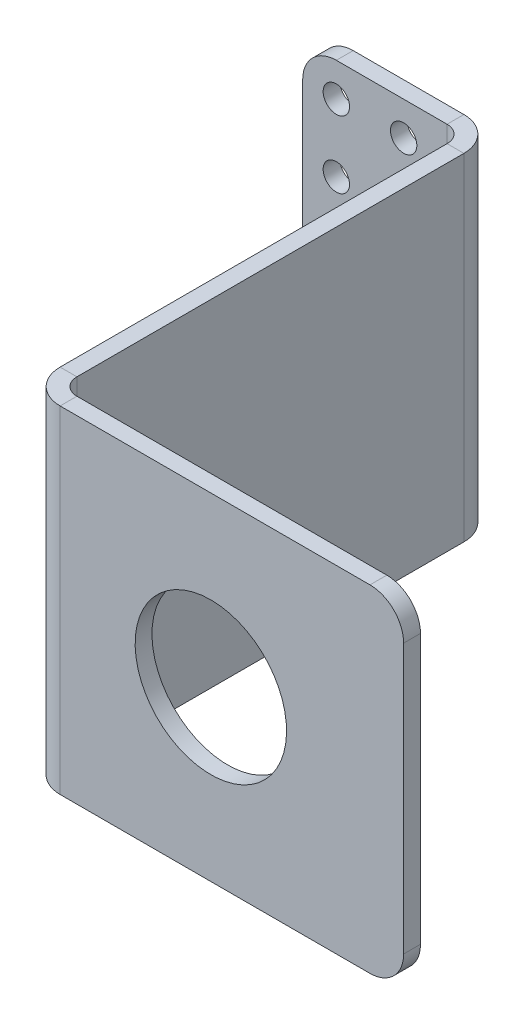
ISO-10303-21;
HEADER;
FILE_DESCRIPTION(('STEP AP214'),'2;1');
FILE_NAME('part.step','',(''),(''),'','','');
FILE_SCHEMA(('AUTOMOTIVE_DESIGN { 1 0 10303 214 1 1 1 1 }'));
ENDSEC;
DATA;
#1=APPLICATION_CONTEXT('core data for automotive mechanical design processes');
#2=APPLICATION_PROTOCOL_DEFINITION('international standard','automotive_design',2000,#1);
#3=PRODUCT_CONTEXT('',#1,'mechanical');
#4=PRODUCT('Part','Part','',(#3));
#5=PRODUCT_RELATED_PRODUCT_CATEGORY('part','',(#4));
#6=PRODUCT_DEFINITION_FORMATION('','',#4);
#7=PRODUCT_DEFINITION_CONTEXT('part definition',#1,'design');
#8=PRODUCT_DEFINITION('design','',#6,#7);
#9=PRODUCT_DEFINITION_SHAPE('','',#8);
#10=(LENGTH_UNIT() NAMED_UNIT(*) SI_UNIT(.MILLI.,.METRE.));
#11=(NAMED_UNIT(*) PLANE_ANGLE_UNIT() SI_UNIT($,.RADIAN.));
#12=(NAMED_UNIT(*) SI_UNIT($,.STERADIAN.) SOLID_ANGLE_UNIT());
#13=UNCERTAINTY_MEASURE_WITH_UNIT(LENGTH_MEASURE(1.E-05),#10,'distance_accuracy_value','');
#14=(GEOMETRIC_REPRESENTATION_CONTEXT(3) GLOBAL_UNCERTAINTY_ASSIGNED_CONTEXT((#13)) GLOBAL_UNIT_ASSIGNED_CONTEXT((#10,
#11,#12)) REPRESENTATION_CONTEXT('',''));
#15=CARTESIAN_POINT('',(0.,0.,0.));
#16=DIRECTION('',(0.,0.,1.));
#17=DIRECTION('',(1.,0.,0.));
#18=AXIS2_PLACEMENT_3D('',#15,#16,#17);
#19=CARTESIAN_POINT('',(33.5975412468198,0.,-28.3784587531803));
#20=DIRECTION('',(1.,0.,0.));
#21=DIRECTION('',(0.,0.,-1.));
#22=AXIS2_PLACEMENT_3D('',#19,#20,#21);
#23=PLANE('',#22);
#24=DIRECTION('',(0.,0.,-1.));
#25=VECTOR('',#24,1.);
#26=CARTESIAN_POINT('',(33.5975412468198,63.5,-28.3784587531803));
#27=LINE('',#26,#25);
#28=CARTESIAN_POINT('',(33.5975412468194,63.5,79.375));
#29=VERTEX_POINT('',#28);
#30=CARTESIAN_POINT('',(33.5975412468197,63.5,6.35000000000002));
#31=VERTEX_POINT('',#30);
#32=EDGE_CURVE('E320',#29,#31,#27,.T.);
#33=ORIENTED_EDGE('',*,*,#32,.F.);
#34=DIRECTION('',(0.,-1.,0.));
#35=VECTOR('',#34,1.);
#36=CARTESIAN_POINT('',(33.5975412468194,0.,79.375));
#37=LINE('',#36,#35);
#38=CARTESIAN_POINT('',(33.5975412468194,0.,79.375));
#39=VERTEX_POINT('',#38);
#40=EDGE_CURVE('E311',#29,#39,#37,.T.);
#41=ORIENTED_EDGE('',*,*,#40,.T.);
#42=DIRECTION('',(0.,0.,-1.));
#43=VECTOR('',#42,1.);
#44=CARTESIAN_POINT('',(33.5975412468198,0.,-28.3784587531803));
#45=LINE('',#44,#43);
#46=CARTESIAN_POINT('',(33.5975412468197,0.,6.35000000000002));
#47=VERTEX_POINT('',#46);
#48=EDGE_CURVE('E258',#47,#39,#45,.F.);
#49=ORIENTED_EDGE('',*,*,#48,.F.);
#50=DIRECTION('',(0.,-1.,0.));
#51=VECTOR('',#50,1.);
#52=CARTESIAN_POINT('',(33.5975412468197,0.,6.35000000000002));
#53=LINE('',#52,#51);
#54=EDGE_CURVE('E298',#31,#47,#53,.T.);
#55=ORIENTED_EDGE('',*,*,#54,.F.);
#56=EDGE_LOOP('',(#33,#41,#49,#55));
#57=FACE_BOUND('',#56,.T.);
#58=ADVANCED_FACE('F58',(#57),#23,.T.);
#59=CARTESIAN_POINT('',(30.4225412468198,0.,-28.3784587531804));
#60=DIRECTION('',(0.,1.,0.));
#61=DIRECTION('',(0.,0.,1.));
#62=AXIS2_PLACEMENT_3D('',#59,#60,#61);
#63=PLANE('',#62);
#64=ORIENTED_EDGE('',*,*,#48,.T.);
#65=DIRECTION('',(-1.,0.,0.));
#66=VECTOR('',#65,1.);
#67=CARTESIAN_POINT('',(30.4225412468194,0.,79.375));
#68=LINE('',#67,#66);
#69=CARTESIAN_POINT('',(30.4225412468194,0.,79.375));
#70=VERTEX_POINT('',#69);
#71=EDGE_CURVE('E209',#39,#70,#68,.T.);
#72=ORIENTED_EDGE('',*,*,#71,.T.);
#73=DIRECTION('',(0.,0.,1.));
#74=VECTOR('',#73,1.);
#75=CARTESIAN_POINT('',(30.4225412468198,0.,-28.3784587531804));
#76=LINE('',#75,#74);
#77=CARTESIAN_POINT('',(30.4225412468197,0.,6.35));
#78=VERTEX_POINT('',#77);
#79=EDGE_CURVE('E323',#78,#70,#76,.T.);
#80=ORIENTED_EDGE('',*,*,#79,.F.);
#81=DIRECTION('',(-1.,0.,0.));
#82=VECTOR('',#81,1.);
#83=CARTESIAN_POINT('',(30.4225412468197,0.,6.35000000000001));
#84=LINE('',#83,#82);
#85=EDGE_CURVE('E302',#47,#78,#84,.T.);
#86=ORIENTED_EDGE('',*,*,#85,.F.);
#87=EDGE_LOOP('',(#64,#72,#80,#86));
#88=FACE_BOUND('',#87,.T.);
#89=ADVANCED_FACE('F411',(#88),#63,.F.);
#90=CARTESIAN_POINT('',(30.4225412468198,63.5,-28.3784587531804));
#91=DIRECTION('',(0.,-1.,0.));
#92=DIRECTION('',(0.,0.,-1.));
#93=AXIS2_PLACEMENT_3D('',#90,#91,#92);
#94=PLANE('',#93);
#95=DIRECTION('',(0.,0.,-1.));
#96=VECTOR('',#95,1.);
#97=CARTESIAN_POINT('',(30.4225412468198,63.5,-28.3784587531804));
#98=LINE('',#97,#96);
#99=CARTESIAN_POINT('',(30.4225412468194,63.5,79.375));
#100=VERTEX_POINT('',#99);
#101=CARTESIAN_POINT('',(30.4225412468197,63.5,6.35000000000001));
#102=VERTEX_POINT('',#101);
#103=EDGE_CURVE('E295',#100,#102,#98,.T.);
#104=ORIENTED_EDGE('',*,*,#103,.F.);
#105=DIRECTION('',(1.,0.,0.));
#106=VECTOR('',#105,1.);
#107=CARTESIAN_POINT('',(30.4225412468194,63.5,79.375));
#108=LINE('',#107,#106);
#109=EDGE_CURVE('E315',#100,#29,#108,.T.);
#110=ORIENTED_EDGE('',*,*,#109,.T.);
#111=ORIENTED_EDGE('',*,*,#32,.T.);
#112=DIRECTION('',(1.,0.,0.));
#113=VECTOR('',#112,1.);
#114=CARTESIAN_POINT('',(30.4225412468197,63.5,6.35000000000001));
#115=LINE('',#114,#113);
#116=EDGE_CURVE('E294',#102,#31,#115,.T.);
#117=ORIENTED_EDGE('',*,*,#116,.F.);
#118=EDGE_LOOP('',(#104,#110,#111,#117));
#119=FACE_BOUND('',#118,.T.);
#120=ADVANCED_FACE('F416',(#119),#94,.F.);
#121=CARTESIAN_POINT('',(30.4225412468198,0.,-28.3784587531804));
#122=DIRECTION('',(1.,0.,0.));
#123=DIRECTION('',(0.,0.,-1.));
#124=AXIS2_PLACEMENT_3D('',#121,#122,#123);
#125=PLANE('',#124);
#126=DIRECTION('',(0.,-1.,0.));
#127=VECTOR('',#126,1.);
#128=CARTESIAN_POINT('',(30.4225412468194,0.,79.375));
#129=LINE('',#128,#127);
#130=EDGE_CURVE('E306',#100,#70,#129,.T.);
#131=ORIENTED_EDGE('',*,*,#130,.F.);
#132=ORIENTED_EDGE('',*,*,#103,.T.);
#133=DIRECTION('',(0.,-1.,0.));
#134=VECTOR('',#133,1.);
#135=CARTESIAN_POINT('',(30.4225412468197,0.,6.35000000000001));
#136=LINE('',#135,#134);
#137=EDGE_CURVE('E290',#102,#78,#136,.T.);
#138=ORIENTED_EDGE('',*,*,#137,.T.);
#139=ORIENTED_EDGE('',*,*,#79,.T.);
#140=EDGE_LOOP('',(#131,#132,#138,#139));
#141=FACE_BOUND('',#140,.T.);
#142=ADVANCED_FACE('F424',(#141),#125,.F.);
#143=CARTESIAN_POINT('',(0.,0.,3.175));
#144=DIRECTION('',(1.,0.,0.));
#145=DIRECTION('',(0.,-1.,0.));
#146=AXIS2_PLACEMENT_3D('',#143,#144,#145);
#147=PLANE('',#146);
#148=DIRECTION('',(0.,1.,0.));
#149=VECTOR('',#148,1.);
#150=CARTESIAN_POINT('',(0.,0.,0.));
#151=LINE('',#150,#149);
#152=CARTESIAN_POINT('',(0.,57.15,0.));
#153=VERTEX_POINT('',#152);
#154=CARTESIAN_POINT('',(0.,6.35,0.));
#155=VERTEX_POINT('',#154);
#156=EDGE_CURVE('E283',#153,#155,#151,.F.);
#157=ORIENTED_EDGE('',*,*,#156,.T.);
#158=DIRECTION('',(0.,0.,-1.));
#159=VECTOR('',#158,1.);
#160=CARTESIAN_POINT('',(0.,6.35,3.175));
#161=LINE('',#160,#159);
#162=CARTESIAN_POINT('',(0.,6.35,3.175));
#163=VERTEX_POINT('',#162);
#164=EDGE_CURVE('E357',#155,#163,#161,.F.);
#165=ORIENTED_EDGE('',*,*,#164,.T.);
#166=DIRECTION('',(0.,-1.,0.));
#167=VECTOR('',#166,1.);
#168=CARTESIAN_POINT('',(0.,0.,3.175));
#169=LINE('',#168,#167);
#170=CARTESIAN_POINT('',(0.,57.15,3.175));
#171=VERTEX_POINT('',#170);
#172=EDGE_CURVE('E275',#171,#163,#169,.T.);
#173=ORIENTED_EDGE('',*,*,#172,.F.);
#174=DIRECTION('',(0.,0.,-1.));
#175=VECTOR('',#174,1.);
#176=CARTESIAN_POINT('',(0.,57.15,3.175));
#177=LINE('',#176,#175);
#178=EDGE_CURVE('E354',#171,#153,#177,.T.);
#179=ORIENTED_EDGE('',*,*,#178,.T.);
#180=EDGE_LOOP('',(#157,#165,#173,#179));
#181=FACE_BOUND('',#180,.T.);
#182=ADVANCED_FACE('F377',(#181),#147,.F.);
#183=CARTESIAN_POINT('',(0.,0.,3.175));
#184=DIRECTION('',(0.,0.,-1.));
#185=DIRECTION('',(-1.,0.,0.));
#186=AXIS2_PLACEMENT_3D('',#183,#184,#185);
#187=PLANE('',#186);
#188=CARTESIAN_POINT('',(19.0500000000008,31.75,3.175));
#189=DIRECTION('',(0.,0.,1.));
#190=DIRECTION('',(-1.,0.,0.));
#191=AXIS2_PLACEMENT_3D('',#188,#189,#190);
#192=CIRCLE('',#191,2.4892);
#193=CARTESIAN_POINT('',(16.5608000000008,31.75,3.175));
#194=VERTEX_POINT('',#193);
#195=EDGE_CURVE('E594',#194,#194,#192,.T.);
#196=ORIENTED_EDGE('',*,*,#195,.F.);
#197=EDGE_LOOP('',(#196));
#198=FACE_BOUND('',#197,.T.);
#199=CARTESIAN_POINT('',(6.35000000000039,19.05,3.175));
#200=DIRECTION('',(0.,0.,1.));
#201=DIRECTION('',(1.,0.,0.));
#202=AXIS2_PLACEMENT_3D('',#199,#200,#201);
#203=CIRCLE('',#202,2.4892);
#204=CARTESIAN_POINT('',(8.8392000000004,19.05,3.175));
#205=VERTEX_POINT('',#204);
#206=EDGE_CURVE('E603',#205,#205,#203,.T.);
#207=ORIENTED_EDGE('',*,*,#206,.F.);
#208=EDGE_LOOP('',(#207));
#209=FACE_BOUND('',#208,.T.);
#210=CARTESIAN_POINT('',(19.0500000000009,19.05,3.175));
#211=DIRECTION('',(0.,0.,1.));
#212=DIRECTION('',(-1.,0.,0.));
#213=AXIS2_PLACEMENT_3D('',#210,#211,#212);
#214=CIRCLE('',#213,2.4892);
#215=CARTESIAN_POINT('',(16.5608000000009,19.05,3.175));
#216=VERTEX_POINT('',#215);
#217=EDGE_CURVE('E582',#216,#216,#214,.T.);
#218=ORIENTED_EDGE('',*,*,#217,.F.);
#219=EDGE_LOOP('',(#218));
#220=FACE_BOUND('',#219,.T.);
#221=CARTESIAN_POINT('',(6.35000000000053,6.35000000000002,3.175));
#222=DIRECTION('',(0.,0.,1.));
#223=DIRECTION('',(1.,0.,0.));
#224=AXIS2_PLACEMENT_3D('',#221,#222,#223);
#225=CIRCLE('',#224,2.4892);
#226=CARTESIAN_POINT('',(8.83920000000053,6.35000000000002,3.175));
#227=VERTEX_POINT('',#226);
#228=EDGE_CURVE('E577',#227,#227,#225,.T.);
#229=ORIENTED_EDGE('',*,*,#228,.F.);
#230=EDGE_LOOP('',(#229));
#231=FACE_BOUND('',#230,.T.);
#232=CARTESIAN_POINT('',(19.0500000000005,57.15,3.175));
#233=DIRECTION('',(0.,0.,1.));
#234=DIRECTION('',(-1.,0.,0.));
#235=AXIS2_PLACEMENT_3D('',#232,#233,#234);
#236=CIRCLE('',#235,2.4892);
#237=CARTESIAN_POINT('',(16.5608000000005,57.15,3.175));
#238=VERTEX_POINT('',#237);
#239=EDGE_CURVE('E625',#238,#238,#236,.T.);
#240=ORIENTED_EDGE('',*,*,#239,.F.);
#241=EDGE_LOOP('',(#240));
#242=FACE_BOUND('',#241,.T.);
#243=CARTESIAN_POINT('',(6.35000000000013,44.45,3.175));
#244=DIRECTION('',(0.,0.,1.));
#245=DIRECTION('',(1.,0.,0.));
#246=AXIS2_PLACEMENT_3D('',#243,#244,#245);
#247=CIRCLE('',#246,2.4892);
#248=CARTESIAN_POINT('',(8.83920000000013,44.45,3.175));
#249=VERTEX_POINT('',#248);
#250=EDGE_CURVE('E633',#249,#249,#247,.T.);
#251=ORIENTED_EDGE('',*,*,#250,.F.);
#252=EDGE_LOOP('',(#251));
#253=FACE_BOUND('',#252,.T.);
#254=CARTESIAN_POINT('',(19.0500000000007,44.45,3.175));
#255=DIRECTION('',(0.,0.,1.));
#256=DIRECTION('',(-1.,0.,0.));
#257=AXIS2_PLACEMENT_3D('',#254,#255,#256);
#258=CIRCLE('',#257,2.4892);
#259=CARTESIAN_POINT('',(16.5608000000007,44.45,3.175));
#260=VERTEX_POINT('',#259);
#261=EDGE_CURVE('E610',#260,#260,#258,.T.);
#262=ORIENTED_EDGE('',*,*,#261,.F.);
#263=EDGE_LOOP('',(#262));
#264=FACE_BOUND('',#263,.T.);
#265=CARTESIAN_POINT('',(6.35000000000026,31.75,3.175));
#266=DIRECTION('',(0.,0.,1.));
#267=DIRECTION('',(1.,0.,0.));
#268=AXIS2_PLACEMENT_3D('',#265,#266,#267);
#269=CIRCLE('',#268,2.4892);
#270=CARTESIAN_POINT('',(8.83920000000026,31.75,3.175));
#271=VERTEX_POINT('',#270);
#272=EDGE_CURVE('E619',#271,#271,#269,.T.);
#273=ORIENTED_EDGE('',*,*,#272,.F.);
#274=EDGE_LOOP('',(#273));
#275=FACE_BOUND('',#274,.T.);
#276=CARTESIAN_POINT('',(19.0500000000011,6.35000000000002,3.175));
#277=DIRECTION('',(0.,0.,1.));
#278=DIRECTION('',(-1.,0.,0.));
#279=AXIS2_PLACEMENT_3D('',#276,#277,#278);
#280=CIRCLE('',#279,2.4892);
#281=CARTESIAN_POINT('',(16.560800000001,6.35000000000002,3.175));
#282=VERTEX_POINT('',#281);
#283=EDGE_CURVE('E567',#282,#282,#280,.T.);
#284=ORIENTED_EDGE('',*,*,#283,.F.);
#285=EDGE_LOOP('',(#284));
#286=FACE_BOUND('',#285,.T.);
#287=CARTESIAN_POINT('',(6.35,57.15,3.175));
#288=DIRECTION('',(0.,0.,1.));
#289=DIRECTION('',(1.,0.,0.));
#290=AXIS2_PLACEMENT_3D('',#287,#288,#289);
#291=CIRCLE('',#290,2.4892);
#292=CARTESIAN_POINT('',(8.8392,57.15,3.175));
#293=VERTEX_POINT('',#292);
#294=EDGE_CURVE('E629',#293,#293,#291,.T.);
#295=ORIENTED_EDGE('',*,*,#294,.F.);
#296=EDGE_LOOP('',(#295));
#297=FACE_BOUND('',#296,.T.);
#298=ORIENTED_EDGE('',*,*,#172,.T.);
#299=CARTESIAN_POINT('',(6.35,6.35,3.175));
#300=DIRECTION('',(0.,0.,-1.));
#301=DIRECTION('',(-1.,0.,0.));
#302=AXIS2_PLACEMENT_3D('',#299,#300,#301);
#303=CIRCLE('',#302,6.35);
#304=CARTESIAN_POINT('',(6.35,0.,3.175));
#305=VERTEX_POINT('',#304);
#306=EDGE_CURVE('E364',#163,#305,#303,.F.);
#307=ORIENTED_EDGE('',*,*,#306,.T.);
#308=DIRECTION('',(1.,0.,0.));
#309=VECTOR('',#308,1.);
#310=CARTESIAN_POINT('',(0.,0.,3.175));
#311=LINE('',#310,#309);
#312=CARTESIAN_POINT('',(27.2475412468197,0.,3.175));
#313=VERTEX_POINT('',#312);
#314=EDGE_CURVE('E272',#305,#313,#311,.T.);
#315=ORIENTED_EDGE('',*,*,#314,.T.);
#316=DIRECTION('',(0.,-1.,0.));
#317=VECTOR('',#316,1.);
#318=CARTESIAN_POINT('',(27.2475412468197,0.,3.175));
#319=LINE('',#318,#317);
#320=CARTESIAN_POINT('',(27.2475412468197,63.5,3.175));
#321=VERTEX_POINT('',#320);
#322=EDGE_CURVE('E248',#321,#313,#319,.T.);
#323=ORIENTED_EDGE('',*,*,#322,.F.);
#324=DIRECTION('',(-1.,0.,0.));
#325=VECTOR('',#324,1.);
#326=CARTESIAN_POINT('',(0.,63.5,3.175));
#327=LINE('',#326,#325);
#328=CARTESIAN_POINT('',(6.35,63.5,3.175));
#329=VERTEX_POINT('',#328);
#330=EDGE_CURVE('E279',#321,#329,#327,.T.);
#331=ORIENTED_EDGE('',*,*,#330,.T.);
#332=CARTESIAN_POINT('',(6.35,57.15,3.175));
#333=DIRECTION('',(0.,0.,-1.));
#334=DIRECTION('',(-1.,0.,0.));
#335=AXIS2_PLACEMENT_3D('',#332,#333,#334);
#336=CIRCLE('',#335,6.35);
#337=EDGE_CURVE('E361',#329,#171,#336,.F.);
#338=ORIENTED_EDGE('',*,*,#337,.T.);
#339=EDGE_LOOP('',(#298,#307,#315,#323,#331,#338));
#340=FACE_BOUND('',#339,.T.);
#341=ADVANCED_FACE('F382',(#198,#209,#220,#231,#242,#253,#264,#275,#286,#297,#340),#187,.F.);
#342=CARTESIAN_POINT('',(0.,63.5,3.175));
#343=DIRECTION('',(0.,-1.,0.));
#344=DIRECTION('',(-1.,0.,0.));
#345=AXIS2_PLACEMENT_3D('',#342,#343,#344);
#346=PLANE('',#345);
#347=DIRECTION('',(-1.,0.,0.));
#348=VECTOR('',#347,1.);
#349=CARTESIAN_POINT('',(0.,63.5,0.));
#350=LINE('',#349,#348);
#351=CARTESIAN_POINT('',(27.2475412468197,63.5,0.));
#352=VERTEX_POINT('',#351);
#353=CARTESIAN_POINT('',(6.35,63.5,0.));
#354=VERTEX_POINT('',#353);
#355=EDGE_CURVE('E265',#352,#354,#350,.T.);
#356=ORIENTED_EDGE('',*,*,#355,.T.);
#357=DIRECTION('',(0.,0.,-1.));
#358=VECTOR('',#357,1.);
#359=CARTESIAN_POINT('',(6.35,63.5,3.175));
#360=LINE('',#359,#358);
#361=EDGE_CURVE('E12',#354,#329,#360,.F.);
#362=ORIENTED_EDGE('',*,*,#361,.T.);
#363=ORIENTED_EDGE('',*,*,#330,.F.);
#364=DIRECTION('',(0.,0.,-1.));
#365=VECTOR('',#364,1.);
#366=CARTESIAN_POINT('',(27.2475412468197,63.5,3.175));
#367=LINE('',#366,#365);
#368=EDGE_CURVE('E268',#321,#352,#367,.T.);
#369=ORIENTED_EDGE('',*,*,#368,.T.);
#370=EDGE_LOOP('',(#356,#362,#363,#369));
#371=FACE_BOUND('',#370,.T.);
#372=ADVANCED_FACE('F398',(#371),#346,.F.);
#373=CARTESIAN_POINT('',(0.,0.,0.));
#374=DIRECTION('',(0.,0.,-1.));
#375=DIRECTION('',(-1.,0.,0.));
#376=AXIS2_PLACEMENT_3D('',#373,#374,#375);
#377=PLANE('',#376);
#378=CARTESIAN_POINT('',(19.0500000000008,31.75,0.));
#379=DIRECTION('',(0.,0.,1.));
#380=DIRECTION('',(-1.,0.,0.));
#381=AXIS2_PLACEMENT_3D('',#378,#379,#380);
#382=CIRCLE('',#381,2.4892);
#383=CARTESIAN_POINT('',(16.5608000000008,31.75,0.));
#384=VERTEX_POINT('',#383);
#385=EDGE_CURVE('E599',#384,#384,#382,.T.);
#386=ORIENTED_EDGE('',*,*,#385,.T.);
#387=EDGE_LOOP('',(#386));
#388=FACE_BOUND('',#387,.T.);
#389=CARTESIAN_POINT('',(6.35000000000039,19.05,0.));
#390=DIRECTION('',(0.,0.,1.));
#391=DIRECTION('',(1.,0.,0.));
#392=AXIS2_PLACEMENT_3D('',#389,#390,#391);
#393=CIRCLE('',#392,2.4892);
#394=CARTESIAN_POINT('',(8.8392000000004,19.05,0.));
#395=VERTEX_POINT('',#394);
#396=EDGE_CURVE('E586',#395,#395,#393,.T.);
#397=ORIENTED_EDGE('',*,*,#396,.T.);
#398=EDGE_LOOP('',(#397));
#399=FACE_BOUND('',#398,.T.);
#400=CARTESIAN_POINT('',(19.0500000000009,19.05,0.));
#401=DIRECTION('',(0.,0.,1.));
#402=DIRECTION('',(-1.,0.,0.));
#403=AXIS2_PLACEMENT_3D('',#400,#401,#402);
#404=CIRCLE('',#403,2.4892);
#405=CARTESIAN_POINT('',(16.5608000000009,19.05,0.));
#406=VERTEX_POINT('',#405);
#407=EDGE_CURVE('E587',#406,#406,#404,.T.);
#408=ORIENTED_EDGE('',*,*,#407,.T.);
#409=EDGE_LOOP('',(#408));
#410=FACE_BOUND('',#409,.T.);
#411=CARTESIAN_POINT('',(6.35000000000053,6.35000000000002,0.));
#412=DIRECTION('',(0.,0.,1.));
#413=DIRECTION('',(1.,0.,0.));
#414=AXIS2_PLACEMENT_3D('',#411,#412,#413);
#415=CIRCLE('',#414,2.4892);
#416=CARTESIAN_POINT('',(8.83920000000053,6.35000000000002,0.));
#417=VERTEX_POINT('',#416);
#418=EDGE_CURVE('E570',#417,#417,#415,.T.);
#419=ORIENTED_EDGE('',*,*,#418,.T.);
#420=EDGE_LOOP('',(#419));
#421=FACE_BOUND('',#420,.T.);
#422=CARTESIAN_POINT('',(19.0500000000005,57.15,0.));
#423=DIRECTION('',(0.,0.,1.));
#424=DIRECTION('',(-1.,0.,0.));
#425=AXIS2_PLACEMENT_3D('',#422,#423,#424);
#426=CIRCLE('',#425,2.4892);
#427=CARTESIAN_POINT('',(16.5608000000005,57.15,0.));
#428=VERTEX_POINT('',#427);
#429=EDGE_CURVE('E630',#428,#428,#426,.T.);
#430=ORIENTED_EDGE('',*,*,#429,.T.);
#431=EDGE_LOOP('',(#430));
#432=FACE_BOUND('',#431,.T.);
#433=CARTESIAN_POINT('',(6.35000000000013,44.45,0.));
#434=DIRECTION('',(0.,0.,1.));
#435=DIRECTION('',(1.,0.,0.));
#436=AXIS2_PLACEMENT_3D('',#433,#434,#435);
#437=CIRCLE('',#436,2.4892);
#438=CARTESIAN_POINT('',(8.83920000000013,44.45,0.));
#439=VERTEX_POINT('',#438);
#440=EDGE_CURVE('E614',#439,#439,#437,.T.);
#441=ORIENTED_EDGE('',*,*,#440,.T.);
#442=EDGE_LOOP('',(#441));
#443=FACE_BOUND('',#442,.T.);
#444=CARTESIAN_POINT('',(19.0500000000007,44.45,0.));
#445=DIRECTION('',(0.,0.,1.));
#446=DIRECTION('',(-1.,0.,0.));
#447=AXIS2_PLACEMENT_3D('',#444,#445,#446);
#448=CIRCLE('',#447,2.4892);
#449=CARTESIAN_POINT('',(16.5608000000007,44.45,0.));
#450=VERTEX_POINT('',#449);
#451=EDGE_CURVE('E615',#450,#450,#448,.T.);
#452=ORIENTED_EDGE('',*,*,#451,.T.);
#453=EDGE_LOOP('',(#452));
#454=FACE_BOUND('',#453,.T.);
#455=CARTESIAN_POINT('',(6.35000000000026,31.75,0.));
#456=DIRECTION('',(0.,0.,1.));
#457=DIRECTION('',(1.,0.,0.));
#458=AXIS2_PLACEMENT_3D('',#455,#456,#457);
#459=CIRCLE('',#458,2.4892);
#460=CARTESIAN_POINT('',(8.83920000000026,31.75,0.));
#461=VERTEX_POINT('',#460);
#462=EDGE_CURVE('E598',#461,#461,#459,.T.);
#463=ORIENTED_EDGE('',*,*,#462,.T.);
#464=EDGE_LOOP('',(#463));
#465=FACE_BOUND('',#464,.T.);
#466=CARTESIAN_POINT('',(19.0500000000011,6.35000000000002,0.));
#467=DIRECTION('',(0.,0.,1.));
#468=DIRECTION('',(-1.,0.,0.));
#469=AXIS2_PLACEMENT_3D('',#466,#467,#468);
#470=CIRCLE('',#469,2.4892);
#471=CARTESIAN_POINT('',(16.560800000001,6.35000000000002,0.));
#472=VERTEX_POINT('',#471);
#473=EDGE_CURVE('E564',#472,#472,#470,.T.);
#474=ORIENTED_EDGE('',*,*,#473,.T.);
#475=EDGE_LOOP('',(#474));
#476=FACE_BOUND('',#475,.T.);
#477=CARTESIAN_POINT('',(6.35,57.15,0.));
#478=DIRECTION('',(0.,0.,1.));
#479=DIRECTION('',(1.,0.,0.));
#480=AXIS2_PLACEMENT_3D('',#477,#478,#479);
#481=CIRCLE('',#480,2.4892);
#482=CARTESIAN_POINT('',(8.8392,57.15,0.));
#483=VERTEX_POINT('',#482);
#484=EDGE_CURVE('E640',#483,#483,#481,.T.);
#485=ORIENTED_EDGE('',*,*,#484,.T.);
#486=EDGE_LOOP('',(#485));
#487=FACE_BOUND('',#486,.T.);
#488=DIRECTION('',(-1.,0.,0.));
#489=VECTOR('',#488,1.);
#490=CARTESIAN_POINT('',(0.,0.,0.));
#491=LINE('',#490,#489);
#492=CARTESIAN_POINT('',(6.35,0.,0.));
#493=VERTEX_POINT('',#492);
#494=CARTESIAN_POINT('',(27.2475412468197,0.,0.));
#495=VERTEX_POINT('',#494);
#496=EDGE_CURVE('E259',#493,#495,#491,.F.);
#497=ORIENTED_EDGE('',*,*,#496,.F.);
#498=CARTESIAN_POINT('',(6.35,6.35,0.));
#499=DIRECTION('',(0.,0.,-1.));
#500=DIRECTION('',(-1.,0.,0.));
#501=AXIS2_PLACEMENT_3D('',#498,#499,#500);
#502=CIRCLE('',#501,6.35);
#503=EDGE_CURVE('E67',#493,#155,#502,.T.);
#504=ORIENTED_EDGE('',*,*,#503,.T.);
#505=ORIENTED_EDGE('',*,*,#156,.F.);
#506=CARTESIAN_POINT('',(6.35,57.15,0.));
#507=DIRECTION('',(0.,0.,-1.));
#508=DIRECTION('',(-1.,0.,0.));
#509=AXIS2_PLACEMENT_3D('',#506,#507,#508);
#510=CIRCLE('',#509,6.35);
#511=EDGE_CURVE('E74',#153,#354,#510,.T.);
#512=ORIENTED_EDGE('',*,*,#511,.T.);
#513=ORIENTED_EDGE('',*,*,#355,.F.);
#514=DIRECTION('',(0.,-1.,0.));
#515=VECTOR('',#514,1.);
#516=CARTESIAN_POINT('',(27.2475412468197,0.,0.));
#517=LINE('',#516,#515);
#518=EDGE_CURVE('E261',#352,#495,#517,.T.);
#519=ORIENTED_EDGE('',*,*,#518,.T.);
#520=EDGE_LOOP('',(#497,#504,#505,#512,#513,#519));
#521=FACE_BOUND('',#520,.T.);
#522=ADVANCED_FACE('F373',(#388,#399,#410,#421,#432,#443,#454,#465,#476,#487,#521),#377,.T.);
#523=CARTESIAN_POINT('',(0.,0.,3.175));
#524=DIRECTION('',(0.,1.,0.));
#525=DIRECTION('',(1.,0.,0.));
#526=AXIS2_PLACEMENT_3D('',#523,#524,#525);
#527=PLANE('',#526);
#528=ORIENTED_EDGE('',*,*,#314,.F.);
#529=DIRECTION('',(0.,0.,-1.));
#530=VECTOR('',#529,1.);
#531=CARTESIAN_POINT('',(6.35,0.,3.175));
#532=LINE('',#531,#530);
#533=EDGE_CURVE('E82',#305,#493,#532,.T.);
#534=ORIENTED_EDGE('',*,*,#533,.T.);
#535=ORIENTED_EDGE('',*,*,#496,.T.);
#536=DIRECTION('',(0.,0.,1.));
#537=VECTOR('',#536,1.);
#538=CARTESIAN_POINT('',(27.2475412468197,0.,3.175));
#539=LINE('',#538,#537);
#540=EDGE_CURVE('E254',#495,#313,#539,.T.);
#541=ORIENTED_EDGE('',*,*,#540,.T.);
#542=EDGE_LOOP('',(#528,#534,#535,#541));
#543=FACE_BOUND('',#542,.T.);
#544=ADVANCED_FACE('F384',(#543),#527,.F.);
#545=CARTESIAN_POINT('',(27.2475412468197,63.5,6.35));
#546=DIRECTION('',(0.,-1.,0.));
#547=DIRECTION('',(0.,0.,-1.));
#548=AXIS2_PLACEMENT_3D('',#545,#546,#547);
#549=PLANE('',#548);
#550=ORIENTED_EDGE('',*,*,#116,.T.);
#551=CARTESIAN_POINT('',(27.2475412468197,63.5,6.35));
#552=DIRECTION('',(0.,1.,0.));
#553=DIRECTION('',(-1.,0.,0.));
#554=AXIS2_PLACEMENT_3D('',#551,#552,#553);
#555=CIRCLE('',#554,6.35);
#556=EDGE_CURVE('E235',#31,#352,#555,.T.);
#557=ORIENTED_EDGE('',*,*,#556,.T.);
#558=ORIENTED_EDGE('',*,*,#368,.F.);
#559=CARTESIAN_POINT('',(27.2475412468197,63.5,6.35));
#560=DIRECTION('',(0.,1.,0.));
#561=DIRECTION('',(0.,0.,1.));
#562=AXIS2_PLACEMENT_3D('',#559,#560,#561);
#563=CIRCLE('',#562,3.175);
#564=EDGE_CURVE('E239',#102,#321,#563,.T.);
#565=ORIENTED_EDGE('',*,*,#564,.F.);
#566=EDGE_LOOP('',(#550,#557,#558,#565));
#567=FACE_BOUND('',#566,.T.);
#568=ADVANCED_FACE('F401',(#567),#549,.F.);
#569=CARTESIAN_POINT('',(27.2475412468197,0.,6.35));
#570=DIRECTION('',(0.,1.,0.));
#571=DIRECTION('',(-1.,0.,0.));
#572=AXIS2_PLACEMENT_3D('',#569,#570,#571);
#573=PLANE('',#572);
#574=ORIENTED_EDGE('',*,*,#540,.F.);
#575=CARTESIAN_POINT('',(27.2475412468197,0.,6.35));
#576=DIRECTION('',(0.,1.,0.));
#577=DIRECTION('',(-1.,0.,0.));
#578=AXIS2_PLACEMENT_3D('',#575,#576,#577);
#579=CIRCLE('',#578,6.35);
#580=EDGE_CURVE('E244',#495,#47,#579,.F.);
#581=ORIENTED_EDGE('',*,*,#580,.T.);
#582=ORIENTED_EDGE('',*,*,#85,.T.);
#583=CARTESIAN_POINT('',(27.2475412468197,0.,6.35));
#584=DIRECTION('',(0.,-1.,0.));
#585=DIRECTION('',(1.,0.,0.));
#586=AXIS2_PLACEMENT_3D('',#583,#584,#585);
#587=CIRCLE('',#586,3.175);
#588=EDGE_CURVE('E243',#313,#78,#587,.T.);
#589=ORIENTED_EDGE('',*,*,#588,.F.);
#590=EDGE_LOOP('',(#574,#581,#582,#589));
#591=FACE_BOUND('',#590,.T.);
#592=ADVANCED_FACE('F389',(#591),#573,.F.);
#593=CARTESIAN_POINT('',(27.2475412468197,-32.2679252376784,6.35));
#594=DIRECTION('',(0.,1.,0.));
#595=DIRECTION('',(-1.,0.,0.));
#596=AXIS2_PLACEMENT_3D('',#593,#594,#595);
#597=CYLINDRICAL_SURFACE('',#596,3.175);
#598=ORIENTED_EDGE('',*,*,#588,.T.);
#599=ORIENTED_EDGE('',*,*,#137,.F.);
#600=ORIENTED_EDGE('',*,*,#564,.T.);
#601=ORIENTED_EDGE('',*,*,#322,.T.);
#602=EDGE_LOOP('',(#598,#599,#600,#601));
#603=FACE_BOUND('',#602,.T.);
#604=ADVANCED_FACE('F404',(#603),#597,.F.);
#605=CARTESIAN_POINT('',(27.2475412468197,-32.2679252376784,6.35));
#606=DIRECTION('',(0.,1.,0.));
#607=DIRECTION('',(-1.,0.,0.));
#608=AXIS2_PLACEMENT_3D('',#605,#606,#607);
#609=CYLINDRICAL_SURFACE('',#608,6.35);
#610=ORIENTED_EDGE('',*,*,#580,.F.);
#611=ORIENTED_EDGE('',*,*,#518,.F.);
#612=ORIENTED_EDGE('',*,*,#556,.F.);
#613=ORIENTED_EDGE('',*,*,#54,.T.);
#614=EDGE_LOOP('',(#610,#611,#612,#613));
#615=FACE_BOUND('',#614,.T.);
#616=ADVANCED_FACE('F392',(#615),#609,.T.);
#617=CARTESIAN_POINT('',(36.7725412468194,63.5,79.3750000000001));
#618=DIRECTION('',(0.,1.,0.));
#619=DIRECTION('',(0.,0.,1.));
#620=AXIS2_PLACEMENT_3D('',#617,#618,#619);
#621=PLANE('',#620);
#622=DIRECTION('',(0.,0.,-1.));
#623=VECTOR('',#622,1.);
#624=CARTESIAN_POINT('',(36.7725412468194,63.5,85.725));
#625=LINE('',#624,#623);
#626=CARTESIAN_POINT('',(36.7725412468194,63.5,85.725));
#627=VERTEX_POINT('',#626);
#628=CARTESIAN_POINT('',(36.7725412468194,63.5,82.55));
#629=VERTEX_POINT('',#628);
#630=EDGE_CURVE('E220',#627,#629,#625,.T.);
#631=ORIENTED_EDGE('',*,*,#630,.T.);
#632=CARTESIAN_POINT('',(36.7725412468194,63.5,79.3750000000001));
#633=DIRECTION('',(0.,1.,0.));
#634=DIRECTION('',(-1.,0.,0.));
#635=AXIS2_PLACEMENT_3D('',#632,#633,#634);
#636=CIRCLE('',#635,3.175);
#637=EDGE_CURVE('E215',#629,#29,#636,.F.);
#638=ORIENTED_EDGE('',*,*,#637,.T.);
#639=ORIENTED_EDGE('',*,*,#109,.F.);
#640=CARTESIAN_POINT('',(36.7725412468194,63.5,79.3750000000001));
#641=DIRECTION('',(0.,-1.,0.));
#642=DIRECTION('',(0.,0.,-1.));
#643=AXIS2_PLACEMENT_3D('',#640,#641,#642);
#644=CIRCLE('',#643,6.34999999999999);
#645=EDGE_CURVE('E214',#627,#100,#644,.T.);
#646=ORIENTED_EDGE('',*,*,#645,.F.);
#647=EDGE_LOOP('',(#631,#638,#639,#646));
#648=FACE_BOUND('',#647,.T.);
#649=ADVANCED_FACE('F467',(#648),#621,.T.);
#650=CARTESIAN_POINT('',(36.7725412468194,0.,79.3750000000001));
#651=DIRECTION('',(0.,-1.,0.));
#652=DIRECTION('',(1.,0.,0.));
#653=AXIS2_PLACEMENT_3D('',#650,#651,#652);
#654=PLANE('',#653);
#655=ORIENTED_EDGE('',*,*,#71,.F.);
#656=CARTESIAN_POINT('',(36.7725412468194,0.,79.3750000000001));
#657=DIRECTION('',(0.,1.,0.));
#658=DIRECTION('',(-1.,0.,0.));
#659=AXIS2_PLACEMENT_3D('',#656,#657,#658);
#660=CIRCLE('',#659,3.175);
#661=CARTESIAN_POINT('',(36.7725412468194,0.,82.55));
#662=VERTEX_POINT('',#661);
#663=EDGE_CURVE('E206',#39,#662,#660,.T.);
#664=ORIENTED_EDGE('',*,*,#663,.T.);
#665=DIRECTION('',(0.,0.,1.));
#666=VECTOR('',#665,1.);
#667=CARTESIAN_POINT('',(36.7725412468194,0.,85.725));
#668=LINE('',#667,#666);
#669=CARTESIAN_POINT('',(36.7725412468194,0.,85.7250000000001));
#670=VERTEX_POINT('',#669);
#671=EDGE_CURVE('E193',#662,#670,#668,.T.);
#672=ORIENTED_EDGE('',*,*,#671,.T.);
#673=CARTESIAN_POINT('',(36.7725412468194,0.,79.3750000000001));
#674=DIRECTION('',(0.,1.,0.));
#675=DIRECTION('',(-1.,0.,0.));
#676=AXIS2_PLACEMENT_3D('',#673,#674,#675);
#677=CIRCLE('',#676,6.35);
#678=EDGE_CURVE('E233',#70,#670,#677,.T.);
#679=ORIENTED_EDGE('',*,*,#678,.F.);
#680=EDGE_LOOP('',(#655,#664,#672,#679));
#681=FACE_BOUND('',#680,.T.);
#682=ADVANCED_FACE('F207',(#681),#654,.T.);
#683=CARTESIAN_POINT('',(36.7725412468194,-32.2679252376783,79.3750000000001));
#684=DIRECTION('',(0.,1.,0.));
#685=DIRECTION('',(-1.,0.,0.));
#686=AXIS2_PLACEMENT_3D('',#683,#684,#685);
#687=CYLINDRICAL_SURFACE('',#686,6.35);
#688=ORIENTED_EDGE('',*,*,#678,.T.);
#689=DIRECTION('',(0.,-1.,0.));
#690=VECTOR('',#689,1.);
#691=CARTESIAN_POINT('',(36.7725412468194,0.,85.725));
#692=LINE('',#691,#690);
#693=EDGE_CURVE('E440',#627,#670,#692,.T.);
#694=ORIENTED_EDGE('',*,*,#693,.F.);
#695=ORIENTED_EDGE('',*,*,#645,.T.);
#696=ORIENTED_EDGE('',*,*,#130,.T.);
#697=EDGE_LOOP('',(#688,#694,#695,#696));
#698=FACE_BOUND('',#697,.T.);
#699=ADVANCED_FACE('F470',(#698),#687,.T.);
#700=CARTESIAN_POINT('',(36.7725412468194,-32.2679252376783,79.3750000000001));
#701=DIRECTION('',(0.,1.,0.));
#702=DIRECTION('',(-1.,0.,0.));
#703=AXIS2_PLACEMENT_3D('',#700,#701,#702);
#704=CYLINDRICAL_SURFACE('',#703,3.175);
#705=ORIENTED_EDGE('',*,*,#663,.F.);
#706=ORIENTED_EDGE('',*,*,#40,.F.);
#707=ORIENTED_EDGE('',*,*,#637,.F.);
#708=DIRECTION('',(0.,-1.,0.));
#709=VECTOR('',#708,1.);
#710=CARTESIAN_POINT('',(36.7725412468194,0.,82.55));
#711=LINE('',#710,#709);
#712=EDGE_CURVE('E180',#629,#662,#711,.T.);
#713=ORIENTED_EDGE('',*,*,#712,.T.);
#714=EDGE_LOOP('',(#705,#706,#707,#713));
#715=FACE_BOUND('',#714,.T.);
#716=ADVANCED_FACE('F218',(#715),#704,.F.);
#717=CARTESIAN_POINT('',(101.6,0.,85.725));
#718=DIRECTION('',(-1.,0.,0.));
#719=DIRECTION('',(0.,1.,0.));
#720=AXIS2_PLACEMENT_3D('',#717,#718,#719);
#721=PLANE('',#720);
#722=DIRECTION('',(0.,1.,0.));
#723=VECTOR('',#722,1.);
#724=CARTESIAN_POINT('',(101.6,0.,82.55));
#725=LINE('',#724,#723);
#726=CARTESIAN_POINT('',(101.6,6.35,82.55));
#727=VERTEX_POINT('',#726);
#728=CARTESIAN_POINT('',(101.6,57.15,82.55));
#729=VERTEX_POINT('',#728);
#730=EDGE_CURVE('E203',#727,#729,#725,.T.);
#731=ORIENTED_EDGE('',*,*,#730,.T.);
#732=DIRECTION('',(0.,0.,-1.));
#733=VECTOR('',#732,1.);
#734=CARTESIAN_POINT('',(101.6,57.15,85.725));
#735=LINE('',#734,#733);
#736=CARTESIAN_POINT('',(101.6,57.15,85.725));
#737=VERTEX_POINT('',#736);
#738=EDGE_CURVE('E333',#729,#737,#735,.F.);
#739=ORIENTED_EDGE('',*,*,#738,.T.);
#740=DIRECTION('',(0.,1.,0.));
#741=VECTOR('',#740,1.);
#742=CARTESIAN_POINT('',(101.6,0.,85.725));
#743=LINE('',#742,#741);
#744=CARTESIAN_POINT('',(101.6,6.35,85.725));
#745=VERTEX_POINT('',#744);
#746=EDGE_CURVE('E190',#745,#737,#743,.T.);
#747=ORIENTED_EDGE('',*,*,#746,.F.);
#748=DIRECTION('',(0.,0.,-1.));
#749=VECTOR('',#748,1.);
#750=CARTESIAN_POINT('',(101.6,6.35,85.725));
#751=LINE('',#750,#749);
#752=EDGE_CURVE('E319',#745,#727,#751,.T.);
#753=ORIENTED_EDGE('',*,*,#752,.T.);
#754=EDGE_LOOP('',(#731,#739,#747,#753));
#755=FACE_BOUND('',#754,.T.);
#756=ADVANCED_FACE('F458',(#755),#721,.F.);
#757=CARTESIAN_POINT('',(-78.4618350127217,0.,85.725));
#758=DIRECTION('',(0.,0.,-1.));
#759=DIRECTION('',(-1.,0.,0.));
#760=AXIS2_PLACEMENT_3D('',#757,#758,#759);
#761=PLANE('',#760);
#762=CARTESIAN_POINT('',(65.2205412468193,31.7500000000001,85.7250000000001));
#763=DIRECTION('',(0.,0.,-1.));
#764=DIRECTION('',(0.,1.,0.));
#765=AXIS2_PLACEMENT_3D('',#762,#763,#764);
#766=CIRCLE('',#765,14.2875);
#767=CARTESIAN_POINT('',(65.2205412468193,46.0375000000001,85.7250000000001));
#768=VERTEX_POINT('',#767);
#769=EDGE_CURVE('E226',#768,#768,#766,.T.);
#770=ORIENTED_EDGE('',*,*,#769,.T.);
#771=EDGE_LOOP('',(#770));
#772=FACE_BOUND('',#771,.T.);
#773=ORIENTED_EDGE('',*,*,#746,.T.);
#774=CARTESIAN_POINT('',(95.2499999999998,57.15,85.725));
#775=DIRECTION('',(0.,0.,-1.));
#776=DIRECTION('',(0.,1.,0.));
#777=AXIS2_PLACEMENT_3D('',#774,#775,#776);
#778=CIRCLE('',#777,6.35);
#779=CARTESIAN_POINT('',(95.2499999999998,63.5,85.725));
#780=VERTEX_POINT('',#779);
#781=EDGE_CURVE('E340',#737,#780,#778,.F.);
#782=ORIENTED_EDGE('',*,*,#781,.T.);
#783=DIRECTION('',(-1.,0.,0.));
#784=VECTOR('',#783,1.);
#785=CARTESIAN_POINT('',(-78.4618350127217,63.5,85.725));
#786=LINE('',#785,#784);
#787=EDGE_CURVE('E448',#780,#627,#786,.T.);
#788=ORIENTED_EDGE('',*,*,#787,.T.);
#789=ORIENTED_EDGE('',*,*,#693,.T.);
#790=DIRECTION('',(1.,0.,0.));
#791=VECTOR('',#790,1.);
#792=CARTESIAN_POINT('',(-78.4618350127217,0.,85.725));
#793=LINE('',#792,#791);
#794=CARTESIAN_POINT('',(95.2499999999998,0.,85.725));
#795=VERTEX_POINT('',#794);
#796=EDGE_CURVE('E197',#670,#795,#793,.T.);
#797=ORIENTED_EDGE('',*,*,#796,.T.);
#798=CARTESIAN_POINT('',(95.2499999999998,6.35,85.725));
#799=DIRECTION('',(0.,0.,-1.));
#800=DIRECTION('',(0.,1.,0.));
#801=AXIS2_PLACEMENT_3D('',#798,#799,#800);
#802=CIRCLE('',#801,6.35);
#803=EDGE_CURVE('E337',#795,#745,#802,.F.);
#804=ORIENTED_EDGE('',*,*,#803,.T.);
#805=EDGE_LOOP('',(#773,#782,#788,#789,#797,#804));
#806=FACE_BOUND('',#805,.T.);
#807=ADVANCED_FACE('F437',(#772,#806),#761,.F.);
#808=CARTESIAN_POINT('',(-78.4618350127217,0.,85.725));
#809=DIRECTION('',(0.,1.,0.));
#810=DIRECTION('',(1.,0.,0.));
#811=AXIS2_PLACEMENT_3D('',#808,#809,#810);
#812=PLANE('',#811);
#813=DIRECTION('',(-1.,0.,0.));
#814=VECTOR('',#813,1.);
#815=CARTESIAN_POINT('',(-78.4618350127217,0.,82.55));
#816=LINE('',#815,#814);
#817=CARTESIAN_POINT('',(95.2499999999998,0.,82.55));
#818=VERTEX_POINT('',#817);
#819=EDGE_CURVE('E175',#662,#818,#816,.F.);
#820=ORIENTED_EDGE('',*,*,#819,.T.);
#821=DIRECTION('',(0.,0.,-1.));
#822=VECTOR('',#821,1.);
#823=CARTESIAN_POINT('',(95.2499999999998,0.,85.725));
#824=LINE('',#823,#822);
#825=EDGE_CURVE('E351',#818,#795,#824,.F.);
#826=ORIENTED_EDGE('',*,*,#825,.T.);
#827=ORIENTED_EDGE('',*,*,#796,.F.);
#828=ORIENTED_EDGE('',*,*,#671,.F.);
#829=EDGE_LOOP('',(#820,#826,#827,#828));
#830=FACE_BOUND('',#829,.T.);
#831=ADVANCED_FACE('F195',(#830),#812,.F.);
#832=CARTESIAN_POINT('',(-78.4618350127217,0.,82.55));
#833=DIRECTION('',(0.,0.,-1.));
#834=DIRECTION('',(-1.,0.,0.));
#835=AXIS2_PLACEMENT_3D('',#832,#833,#834);
#836=PLANE('',#835);
#837=CARTESIAN_POINT('',(65.2205412468193,31.7500000000001,82.55));
#838=DIRECTION('',(0.,0.,-1.));
#839=DIRECTION('',(0.,1.,0.));
#840=AXIS2_PLACEMENT_3D('',#837,#838,#839);
#841=CIRCLE('',#840,14.2875);
#842=CARTESIAN_POINT('',(65.2205412468193,46.0375000000001,82.55));
#843=VERTEX_POINT('',#842);
#844=EDGE_CURVE('E644',#843,#843,#841,.T.);
#845=ORIENTED_EDGE('',*,*,#844,.F.);
#846=EDGE_LOOP('',(#845));
#847=FACE_BOUND('',#846,.T.);
#848=DIRECTION('',(-1.,0.,0.));
#849=VECTOR('',#848,1.);
#850=CARTESIAN_POINT('',(-78.4618350127217,63.5,82.55));
#851=LINE('',#850,#849);
#852=CARTESIAN_POINT('',(95.2499999999998,63.5,82.55));
#853=VERTEX_POINT('',#852);
#854=EDGE_CURVE('E189',#853,#629,#851,.T.);
#855=ORIENTED_EDGE('',*,*,#854,.F.);
#856=CARTESIAN_POINT('',(95.2499999999998,57.15,82.55));
#857=DIRECTION('',(0.,0.,-1.));
#858=DIRECTION('',(0.,1.,0.));
#859=AXIS2_PLACEMENT_3D('',#856,#857,#858);
#860=CIRCLE('',#859,6.35);
#861=EDGE_CURVE('E348',#853,#729,#860,.T.);
#862=ORIENTED_EDGE('',*,*,#861,.T.);
#863=ORIENTED_EDGE('',*,*,#730,.F.);
#864=CARTESIAN_POINT('',(95.2499999999998,6.35,82.55));
#865=DIRECTION('',(0.,0.,-1.));
#866=DIRECTION('',(0.,1.,0.));
#867=AXIS2_PLACEMENT_3D('',#864,#865,#866);
#868=CIRCLE('',#867,6.35);
#869=EDGE_CURVE('E184',#727,#818,#868,.T.);
#870=ORIENTED_EDGE('',*,*,#869,.T.);
#871=ORIENTED_EDGE('',*,*,#819,.F.);
#872=ORIENTED_EDGE('',*,*,#712,.F.);
#873=EDGE_LOOP('',(#855,#862,#863,#870,#871,#872));
#874=FACE_BOUND('',#873,.T.);
#875=ADVANCED_FACE('F178',(#847,#874),#836,.T.);
#876=CARTESIAN_POINT('',(-78.4618350127217,63.5,85.725));
#877=DIRECTION('',(0.,-1.,0.));
#878=DIRECTION('',(-1.,0.,0.));
#879=AXIS2_PLACEMENT_3D('',#876,#877,#878);
#880=PLANE('',#879);
#881=ORIENTED_EDGE('',*,*,#787,.F.);
#882=DIRECTION('',(0.,0.,-1.));
#883=VECTOR('',#882,1.);
#884=CARTESIAN_POINT('',(95.2499999999998,63.5,85.725));
#885=LINE('',#884,#883);
#886=EDGE_CURVE('E343',#780,#853,#885,.T.);
#887=ORIENTED_EDGE('',*,*,#886,.T.);
#888=ORIENTED_EDGE('',*,*,#854,.T.);
#889=ORIENTED_EDGE('',*,*,#630,.F.);
#890=EDGE_LOOP('',(#881,#887,#888,#889));
#891=FACE_BOUND('',#890,.T.);
#892=ADVANCED_FACE('F464',(#891),#880,.F.);
#893=CARTESIAN_POINT('',(65.2205412468193,31.7500000000001,85.7250000000001));
#894=DIRECTION('',(0.,0.,-1.));
#895=DIRECTION('',(0.,1.,0.));
#896=AXIS2_PLACEMENT_3D('',#893,#894,#895);
#897=CYLINDRICAL_SURFACE('',#896,14.2875);
#898=ORIENTED_EDGE('',*,*,#769,.F.);
#899=EDGE_LOOP('',(#898));
#900=FACE_BOUND('',#899,.T.);
#901=ORIENTED_EDGE('',*,*,#844,.T.);
#902=EDGE_LOOP('',(#901));
#903=FACE_BOUND('',#902,.T.);
#904=ADVANCED_FACE('F508',(#900,#903),#897,.F.);
#905=CARTESIAN_POINT('',(6.35,57.15,0.));
#906=DIRECTION('',(0.,0.,1.));
#907=DIRECTION('',(1.,0.,0.));
#908=AXIS2_PLACEMENT_3D('',#905,#906,#907);
#909=CYLINDRICAL_SURFACE('',#908,2.4892);
#910=ORIENTED_EDGE('',*,*,#484,.F.);
#911=EDGE_LOOP('',(#910));
#912=FACE_BOUND('',#911,.T.);
#913=ORIENTED_EDGE('',*,*,#294,.T.);
#914=EDGE_LOOP('',(#913));
#915=FACE_BOUND('',#914,.T.);
#916=ADVANCED_FACE('F521',(#912,#915),#909,.F.);
#917=CARTESIAN_POINT('',(19.0500000000011,6.35000000000002,0.));
#918=DIRECTION('',(0.,0.,1.));
#919=DIRECTION('',(1.,0.,0.));
#920=AXIS2_PLACEMENT_3D('',#917,#918,#919);
#921=CYLINDRICAL_SURFACE('',#920,2.4892);
#922=ORIENTED_EDGE('',*,*,#473,.F.);
#923=EDGE_LOOP('',(#922));
#924=FACE_BOUND('',#923,.T.);
#925=ORIENTED_EDGE('',*,*,#283,.T.);
#926=EDGE_LOOP('',(#925));
#927=FACE_BOUND('',#926,.T.);
#928=ADVANCED_FACE('F525',(#924,#927),#921,.F.);
#929=CARTESIAN_POINT('',(6.35000000000026,31.75,0.));
#930=DIRECTION('',(0.,0.,1.));
#931=DIRECTION('',(1.,0.,0.));
#932=AXIS2_PLACEMENT_3D('',#929,#930,#931);
#933=CYLINDRICAL_SURFACE('',#932,2.4892);
#934=ORIENTED_EDGE('',*,*,#462,.F.);
#935=EDGE_LOOP('',(#934));
#936=FACE_BOUND('',#935,.T.);
#937=ORIENTED_EDGE('',*,*,#272,.T.);
#938=EDGE_LOOP('',(#937));
#939=FACE_BOUND('',#938,.T.);
#940=ADVANCED_FACE('F537',(#936,#939),#933,.F.);
#941=CARTESIAN_POINT('',(19.0500000000007,44.45,0.));
#942=DIRECTION('',(0.,0.,1.));
#943=DIRECTION('',(1.,0.,0.));
#944=AXIS2_PLACEMENT_3D('',#941,#942,#943);
#945=CYLINDRICAL_SURFACE('',#944,2.4892);
#946=ORIENTED_EDGE('',*,*,#451,.F.);
#947=EDGE_LOOP('',(#946));
#948=FACE_BOUND('',#947,.T.);
#949=ORIENTED_EDGE('',*,*,#261,.T.);
#950=EDGE_LOOP('',(#949));
#951=FACE_BOUND('',#950,.T.);
#952=ADVANCED_FACE('F531',(#948,#951),#945,.F.);
#953=CARTESIAN_POINT('',(6.35000000000013,44.45,0.));
#954=DIRECTION('',(0.,0.,1.));
#955=DIRECTION('',(1.,0.,0.));
#956=AXIS2_PLACEMENT_3D('',#953,#954,#955);
#957=CYLINDRICAL_SURFACE('',#956,2.4892);
#958=ORIENTED_EDGE('',*,*,#440,.F.);
#959=EDGE_LOOP('',(#958));
#960=FACE_BOUND('',#959,.T.);
#961=ORIENTED_EDGE('',*,*,#250,.T.);
#962=EDGE_LOOP('',(#961));
#963=FACE_BOUND('',#962,.T.);
#964=ADVANCED_FACE('F527',(#960,#963),#957,.F.);
#965=CARTESIAN_POINT('',(19.0500000000005,57.15,0.));
#966=DIRECTION('',(0.,0.,1.));
#967=DIRECTION('',(1.,0.,0.));
#968=AXIS2_PLACEMENT_3D('',#965,#966,#967);
#969=CYLINDRICAL_SURFACE('',#968,2.4892);
#970=ORIENTED_EDGE('',*,*,#429,.F.);
#971=EDGE_LOOP('',(#970));
#972=FACE_BOUND('',#971,.T.);
#973=ORIENTED_EDGE('',*,*,#239,.T.);
#974=EDGE_LOOP('',(#973));
#975=FACE_BOUND('',#974,.T.);
#976=ADVANCED_FACE('F530',(#972,#975),#969,.F.);
#977=CARTESIAN_POINT('',(6.35000000000053,6.35000000000002,0.));
#978=DIRECTION('',(0.,0.,1.));
#979=DIRECTION('',(1.,0.,0.));
#980=AXIS2_PLACEMENT_3D('',#977,#978,#979);
#981=CYLINDRICAL_SURFACE('',#980,2.4892);
#982=ORIENTED_EDGE('',*,*,#418,.F.);
#983=EDGE_LOOP('',(#982));
#984=FACE_BOUND('',#983,.T.);
#985=ORIENTED_EDGE('',*,*,#228,.T.);
#986=EDGE_LOOP('',(#985));
#987=FACE_BOUND('',#986,.T.);
#988=ADVANCED_FACE('F535',(#984,#987),#981,.F.);
#989=CARTESIAN_POINT('',(19.0500000000009,19.05,0.));
#990=DIRECTION('',(0.,0.,1.));
#991=DIRECTION('',(1.,0.,0.));
#992=AXIS2_PLACEMENT_3D('',#989,#990,#991);
#993=CYLINDRICAL_SURFACE('',#992,2.4892);
#994=ORIENTED_EDGE('',*,*,#407,.F.);
#995=EDGE_LOOP('',(#994));
#996=FACE_BOUND('',#995,.T.);
#997=ORIENTED_EDGE('',*,*,#217,.T.);
#998=EDGE_LOOP('',(#997));
#999=FACE_BOUND('',#998,.T.);
#1000=ADVANCED_FACE('F547',(#996,#999),#993,.F.);
#1001=CARTESIAN_POINT('',(6.35000000000039,19.05,0.));
#1002=DIRECTION('',(0.,0.,1.));
#1003=DIRECTION('',(1.,0.,0.));
#1004=AXIS2_PLACEMENT_3D('',#1001,#1002,#1003);
#1005=CYLINDRICAL_SURFACE('',#1004,2.4892);
#1006=ORIENTED_EDGE('',*,*,#396,.F.);
#1007=EDGE_LOOP('',(#1006));
#1008=FACE_BOUND('',#1007,.T.);
#1009=ORIENTED_EDGE('',*,*,#206,.T.);
#1010=EDGE_LOOP('',(#1009));
#1011=FACE_BOUND('',#1010,.T.);
#1012=ADVANCED_FACE('F544',(#1008,#1011),#1005,.F.);
#1013=CARTESIAN_POINT('',(19.0500000000008,31.75,0.));
#1014=DIRECTION('',(0.,0.,1.));
#1015=DIRECTION('',(1.,0.,0.));
#1016=AXIS2_PLACEMENT_3D('',#1013,#1014,#1015);
#1017=CYLINDRICAL_SURFACE('',#1016,2.4892);
#1018=ORIENTED_EDGE('',*,*,#385,.F.);
#1019=EDGE_LOOP('',(#1018));
#1020=FACE_BOUND('',#1019,.T.);
#1021=ORIENTED_EDGE('',*,*,#195,.T.);
#1022=EDGE_LOOP('',(#1021));
#1023=FACE_BOUND('',#1022,.T.);
#1024=ADVANCED_FACE('F429',(#1020,#1023),#1017,.F.);
#1025=CARTESIAN_POINT('',(95.2499999999998,57.15,85.725));
#1026=DIRECTION('',(0.,0.,1.));
#1027=DIRECTION('',(0.,-1.,0.));
#1028=AXIS2_PLACEMENT_3D('',#1025,#1026,#1027);
#1029=CYLINDRICAL_SURFACE('',#1028,6.35);
#1030=ORIENTED_EDGE('',*,*,#861,.F.);
#1031=ORIENTED_EDGE('',*,*,#886,.F.);
#1032=ORIENTED_EDGE('',*,*,#781,.F.);
#1033=ORIENTED_EDGE('',*,*,#738,.F.);
#1034=EDGE_LOOP('',(#1030,#1031,#1032,#1033));
#1035=FACE_BOUND('',#1034,.T.);
#1036=ADVANCED_FACE('F426',(#1035),#1029,.T.);
#1037=CARTESIAN_POINT('',(95.2499999999998,6.35,85.725));
#1038=DIRECTION('',(0.,0.,1.));
#1039=DIRECTION('',(0.,-1.,0.));
#1040=AXIS2_PLACEMENT_3D('',#1037,#1038,#1039);
#1041=CYLINDRICAL_SURFACE('',#1040,6.35);
#1042=ORIENTED_EDGE('',*,*,#869,.F.);
#1043=ORIENTED_EDGE('',*,*,#752,.F.);
#1044=ORIENTED_EDGE('',*,*,#803,.F.);
#1045=ORIENTED_EDGE('',*,*,#825,.F.);
#1046=EDGE_LOOP('',(#1042,#1043,#1044,#1045));
#1047=FACE_BOUND('',#1046,.T.);
#1048=ADVANCED_FACE('F409',(#1047),#1041,.T.);
#1049=CARTESIAN_POINT('',(6.35,6.35,3.175));
#1050=DIRECTION('',(0.,0.,1.));
#1051=DIRECTION('',(1.,0.,0.));
#1052=AXIS2_PLACEMENT_3D('',#1049,#1050,#1051);
#1053=CYLINDRICAL_SURFACE('',#1052,6.35);
#1054=ORIENTED_EDGE('',*,*,#503,.F.);
#1055=ORIENTED_EDGE('',*,*,#533,.F.);
#1056=ORIENTED_EDGE('',*,*,#306,.F.);
#1057=ORIENTED_EDGE('',*,*,#164,.F.);
#1058=EDGE_LOOP('',(#1054,#1055,#1056,#1057));
#1059=FACE_BOUND('',#1058,.T.);
#1060=ADVANCED_FACE('F380',(#1059),#1053,.T.);
#1061=CARTESIAN_POINT('',(6.35,57.15,3.175));
#1062=DIRECTION('',(0.,0.,1.));
#1063=DIRECTION('',(1.,0.,0.));
#1064=AXIS2_PLACEMENT_3D('',#1061,#1062,#1063);
#1065=CYLINDRICAL_SURFACE('',#1064,6.35);
#1066=ORIENTED_EDGE('',*,*,#511,.F.);
#1067=ORIENTED_EDGE('',*,*,#178,.F.);
#1068=ORIENTED_EDGE('',*,*,#337,.F.);
#1069=ORIENTED_EDGE('',*,*,#361,.F.);
#1070=EDGE_LOOP('',(#1066,#1067,#1068,#1069));
#1071=FACE_BOUND('',#1070,.T.);
#1072=ADVANCED_FACE('F60',(#1071),#1065,.T.);
#1073=CLOSED_SHELL('',(#58,#89,#120,#142,#182,#341,#372,#522,#544,#568,#592,#604,#616,#649,#682,
#699,#716,#756,#807,#831,#875,#892,#904,#916,#928,#940,#952,#964,#976,#988,#1000,#1012,#1024,
#1036,#1048,#1060,#1072));
#1074=MANIFOLD_SOLID_BREP('B2',#1073);
#1075=ADVANCED_BREP_SHAPE_REPRESENTATION('',(#18,#1074),#14);
#1076=SHAPE_DEFINITION_REPRESENTATION(#9,#1075);
ENDSEC;
END-ISO-10303-21;
